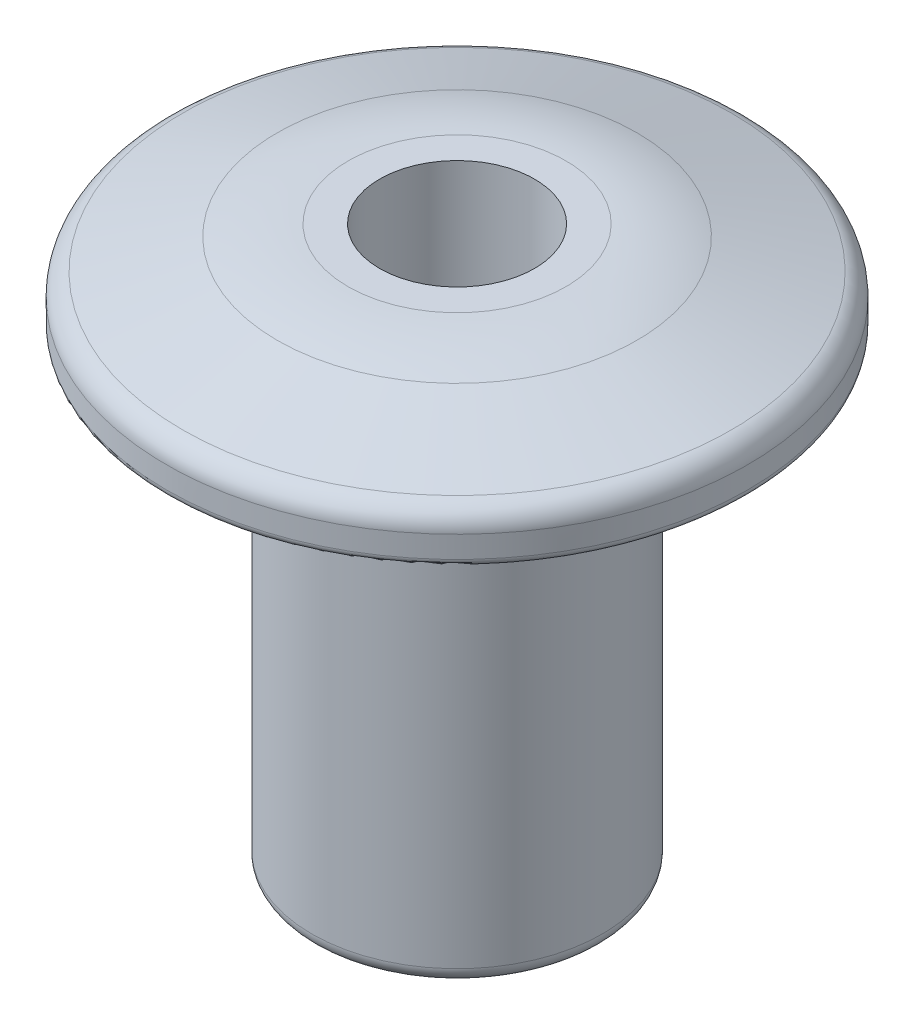
ISO-10303-21;
HEADER;
FILE_DESCRIPTION(('STEP AP214'),'2;1');
FILE_NAME('part.step','',(''),(''),'','','');
FILE_SCHEMA(('AUTOMOTIVE_DESIGN { 1 0 10303 214 1 1 1 1 }'));
ENDSEC;
DATA;
#1=APPLICATION_CONTEXT('core data for automotive mechanical design processes');
#2=APPLICATION_PROTOCOL_DEFINITION('international standard','automotive_design',2000,#1);
#3=PRODUCT_CONTEXT('',#1,'mechanical');
#4=PRODUCT('Part','Part','',(#3));
#5=PRODUCT_RELATED_PRODUCT_CATEGORY('part','',(#4));
#6=PRODUCT_DEFINITION_FORMATION('','',#4);
#7=PRODUCT_DEFINITION_CONTEXT('part definition',#1,'design');
#8=PRODUCT_DEFINITION('design','',#6,#7);
#9=PRODUCT_DEFINITION_SHAPE('','',#8);
#10=(LENGTH_UNIT() NAMED_UNIT(*) SI_UNIT(.MILLI.,.METRE.));
#11=(NAMED_UNIT(*) PLANE_ANGLE_UNIT() SI_UNIT($,.RADIAN.));
#12=(NAMED_UNIT(*) SI_UNIT($,.STERADIAN.) SOLID_ANGLE_UNIT());
#13=UNCERTAINTY_MEASURE_WITH_UNIT(LENGTH_MEASURE(1.E-05),#10,'distance_accuracy_value','');
#14=(GEOMETRIC_REPRESENTATION_CONTEXT(3) GLOBAL_UNCERTAINTY_ASSIGNED_CONTEXT((#13)) GLOBAL_UNIT_ASSIGNED_CONTEXT((#10,
#11,#12)) REPRESENTATION_CONTEXT('',''));
#15=CARTESIAN_POINT('',(0.,0.,0.));
#16=DIRECTION('',(0.,0.,1.));
#17=DIRECTION('',(1.,0.,0.));
#18=AXIS2_PLACEMENT_3D('',#15,#16,#17);
#19=CARTESIAN_POINT('',(0.,7.62,0.));
#20=DIRECTION('',(0.,-1.,0.));
#21=DIRECTION('',(0.,0.,-1.));
#22=AXIS2_PLACEMENT_3D('',#19,#20,#21);
#23=CYLINDRICAL_SURFACE('',#22,2.38125);
#24=CARTESIAN_POINT('',(0.,0.254,0.));
#25=DIRECTION('',(0.,1.,0.));
#26=DIRECTION('',(0.,0.,1.));
#27=AXIS2_PLACEMENT_3D('',#24,#25,#26);
#28=CIRCLE('',#27,2.38125);
#29=CARTESIAN_POINT('',(0.,0.254,2.38125));
#30=VERTEX_POINT('',#29);
#31=EDGE_CURVE('E65',#30,#30,#28,.T.);
#32=ORIENTED_EDGE('',*,*,#31,.T.);
#33=EDGE_LOOP('',(#32));
#34=FACE_BOUND('',#33,.T.);
#35=CARTESIAN_POINT('',(0.,7.62,0.));
#36=DIRECTION('',(0.,1.,0.));
#37=DIRECTION('',(0.,0.,1.));
#38=AXIS2_PLACEMENT_3D('',#35,#36,#37);
#39=CIRCLE('',#38,2.38125);
#40=CARTESIAN_POINT('',(0.,7.62,2.38125));
#41=VERTEX_POINT('',#40);
#42=EDGE_CURVE('E68',#41,#41,#39,.T.);
#43=ORIENTED_EDGE('',*,*,#42,.F.);
#44=EDGE_LOOP('',(#43));
#45=FACE_BOUND('',#44,.T.);
#46=ADVANCED_FACE('F30',(#34,#45),#23,.T.);
#47=CARTESIAN_POINT('',(0.,0.,0.));
#48=DIRECTION('',(0.,1.,0.));
#49=DIRECTION('',(0.,0.,1.));
#50=AXIS2_PLACEMENT_3D('',#47,#48,#49);
#51=PLANE('',#50);
#52=CARTESIAN_POINT('',(0.,0.,0.));
#53=DIRECTION('',(0.,1.,0.));
#54=DIRECTION('',(0.,0.,1.));
#55=AXIS2_PLACEMENT_3D('',#52,#53,#54);
#56=CIRCLE('',#55,2.12725);
#57=CARTESIAN_POINT('',(0.,0.,2.12725));
#58=VERTEX_POINT('',#57);
#59=EDGE_CURVE('E62',#58,#58,#56,.F.);
#60=ORIENTED_EDGE('',*,*,#59,.T.);
#61=EDGE_LOOP('',(#60));
#62=FACE_BOUND('',#61,.T.);
#63=ADVANCED_FACE('F99',(#62),#51,.F.);
#64=CARTESIAN_POINT('',(0.,9.144,0.));
#65=DIRECTION('',(0.,-1.,0.));
#66=DIRECTION('',(0.,0.,-1.));
#67=AXIS2_PLACEMENT_3D('',#64,#65,#66);
#68=CYLINDRICAL_SURFACE('',#67,4.7625);
#69=CARTESIAN_POINT('',(0.,7.747,0.));
#70=DIRECTION('',(0.,1.,0.));
#71=DIRECTION('',(0.,0.,1.));
#72=AXIS2_PLACEMENT_3D('',#69,#70,#71);
#73=CIRCLE('',#72,4.7625);
#74=CARTESIAN_POINT('',(0.,7.747,4.7625));
#75=VERTEX_POINT('',#74);
#76=EDGE_CURVE('E53',#75,#75,#73,.T.);
#77=ORIENTED_EDGE('',*,*,#76,.T.);
#78=EDGE_LOOP('',(#77));
#79=FACE_BOUND('',#78,.T.);
#80=CARTESIAN_POINT('',(0.,8.10388814326856,0.));
#81=DIRECTION('',(0.,-1.,0.));
#82=DIRECTION('',(0.,0.,-1.));
#83=AXIS2_PLACEMENT_3D('',#80,#81,#82);
#84=CIRCLE('',#83,4.7625);
#85=CARTESIAN_POINT('',(0.,8.10388814326856,-4.7625));
#86=VERTEX_POINT('',#85);
#87=EDGE_CURVE('E56',#86,#86,#84,.T.);
#88=ORIENTED_EDGE('',*,*,#87,.T.);
#89=EDGE_LOOP('',(#88));
#90=FACE_BOUND('',#89,.T.);
#91=ADVANCED_FACE('F105',(#79,#90),#68,.T.);
#92=CARTESIAN_POINT('',(0.,7.62,0.));
#93=DIRECTION('',(0.,1.,0.));
#94=DIRECTION('',(0.,0.,1.));
#95=AXIS2_PLACEMENT_3D('',#92,#93,#94);
#96=PLANE('',#95);
#97=CARTESIAN_POINT('',(0.,7.62,0.));
#98=DIRECTION('',(0.,1.,0.));
#99=DIRECTION('',(0.,0.,1.));
#100=AXIS2_PLACEMENT_3D('',#97,#98,#99);
#101=CIRCLE('',#100,4.6355);
#102=CARTESIAN_POINT('',(0.,7.62,4.6355));
#103=VERTEX_POINT('',#102);
#104=EDGE_CURVE('E50',#103,#103,#101,.F.);
#105=ORIENTED_EDGE('',*,*,#104,.T.);
#106=EDGE_LOOP('',(#105));
#107=FACE_BOUND('',#106,.T.);
#108=ORIENTED_EDGE('',*,*,#42,.T.);
#109=EDGE_LOOP('',(#108));
#110=FACE_BOUND('',#109,.T.);
#111=ADVANCED_FACE('F114',(#107,#110),#96,.F.);
#112=CARTESIAN_POINT('',(0.,0.254,0.));
#113=DIRECTION('',(0.,1.,0.));
#114=DIRECTION('',(0.,0.,1.));
#115=AXIS2_PLACEMENT_3D('',#112,#113,#114);
#116=TOROIDAL_SURFACE('',#115,2.12725,0.254);
#117=ORIENTED_EDGE('',*,*,#59,.F.);
#118=EDGE_LOOP('',(#117));
#119=FACE_BOUND('',#118,.T.);
#120=ORIENTED_EDGE('',*,*,#31,.F.);
#121=EDGE_LOOP('',(#120));
#122=FACE_BOUND('',#121,.T.);
#123=ADVANCED_FACE('F111',(#119,#122),#116,.T.);
#124=CARTESIAN_POINT('',(0.,8.382,0.));
#125=DIRECTION('',(0.,-1.,0.));
#126=DIRECTION('',(0.,0.,-1.));
#127=AXIS2_PLACEMENT_3D('',#124,#125,#126);
#128=CONICAL_SURFACE('',#127,4.7625,1.26109338225244);
#129=CARTESIAN_POINT('',(0.,8.96273600082943,0.));
#130=DIRECTION('',(0.,-1.,0.));
#131=DIRECTION('',(0.,0.,-1.));
#132=AXIS2_PLACEMENT_3D('',#129,#130,#131);
#133=CIRCLE('',#132,2.94769999740805);
#134=CARTESIAN_POINT('',(0.,8.96273600082943,-2.94769999740805));
#135=VERTEX_POINT('',#134);
#136=EDGE_CURVE('E41',#135,#135,#133,.T.);
#137=ORIENTED_EDGE('',*,*,#136,.T.);
#138=EDGE_LOOP('',(#137));
#139=FACE_BOUND('',#138,.T.);
#140=CARTESIAN_POINT('',(0.,8.4667617433515,0.));
#141=DIRECTION('',(0.,1.,0.));
#142=DIRECTION('',(0.,0.,1.));
#143=AXIS2_PLACEMENT_3D('',#140,#141,#142);
#144=CIRCLE('',#143,4.49761955202654);
#145=CARTESIAN_POINT('',(0.,8.4667617433515,4.49761955202654));
#146=VERTEX_POINT('',#145);
#147=EDGE_CURVE('E59',#146,#146,#144,.T.);
#148=ORIENTED_EDGE('',*,*,#147,.T.);
#149=EDGE_LOOP('',(#148));
#150=FACE_BOUND('',#149,.T.);
#151=ADVANCED_FACE('F81',(#139,#150),#128,.T.);
#152=CARTESIAN_POINT('',(0.,9.144,0.));
#153=DIRECTION('',(0.,1.,0.));
#154=DIRECTION('',(0.,0.,1.));
#155=AXIS2_PLACEMENT_3D('',#152,#153,#154);
#156=PLANE('',#155);
#157=CARTESIAN_POINT('',(0.,9.144,0.));
#158=DIRECTION('',(0.,1.,0.));
#159=DIRECTION('',(0.,0.,1.));
#160=AXIS2_PLACEMENT_3D('',#157,#158,#159);
#161=CIRCLE('',#160,1.27);
#162=CARTESIAN_POINT('',(0.,9.144,1.27));
#163=VERTEX_POINT('',#162);
#164=EDGE_CURVE('E71',#163,#163,#161,.T.);
#165=ORIENTED_EDGE('',*,*,#164,.F.);
#166=EDGE_LOOP('',(#165));
#167=FACE_BOUND('',#166,.T.);
#168=CARTESIAN_POINT('',(0.,9.144,0.));
#169=DIRECTION('',(0.,1.,0.));
#170=DIRECTION('',(0.,0.,1.));
#171=AXIS2_PLACEMENT_3D('',#168,#169,#170);
#172=CIRCLE('',#171,1.78650447714263);
#173=CARTESIAN_POINT('',(0.,9.144,1.78650447714263));
#174=VERTEX_POINT('',#173);
#175=EDGE_CURVE('E45',#174,#174,#172,.T.);
#176=ORIENTED_EDGE('',*,*,#175,.T.);
#177=EDGE_LOOP('',(#176));
#178=FACE_BOUND('',#177,.T.);
#179=ADVANCED_FACE('F77',(#167,#178),#156,.T.);
#180=CARTESIAN_POINT('',(0.,8.10388814326856,0.));
#181=DIRECTION('',(0.,-1.,0.));
#182=DIRECTION('',(0.,0.,-1.));
#183=AXIS2_PLACEMENT_3D('',#180,#181,#182);
#184=TOROIDAL_SURFACE('',#183,4.3815,0.381);
#185=ORIENTED_EDGE('',*,*,#87,.F.);
#186=EDGE_LOOP('',(#185));
#187=FACE_BOUND('',#186,.T.);
#188=ORIENTED_EDGE('',*,*,#147,.F.);
#189=EDGE_LOOP('',(#188));
#190=FACE_BOUND('',#189,.T.);
#191=ADVANCED_FACE('F80',(#187,#190),#184,.T.);
#192=CARTESIAN_POINT('',(0.,7.747,0.));
#193=DIRECTION('',(0.,1.,0.));
#194=DIRECTION('',(0.,0.,1.));
#195=AXIS2_PLACEMENT_3D('',#192,#193,#194);
#196=TOROIDAL_SURFACE('',#195,4.6355,0.127);
#197=ORIENTED_EDGE('',*,*,#104,.F.);
#198=EDGE_LOOP('',(#197));
#199=FACE_BOUND('',#198,.T.);
#200=ORIENTED_EDGE('',*,*,#76,.F.);
#201=EDGE_LOOP('',(#200));
#202=FACE_BOUND('',#201,.T.);
#203=ADVANCED_FACE('F87',(#199,#202),#196,.T.);
#204=CARTESIAN_POINT('',(0.,5.334,0.));
#205=DIRECTION('',(0.,1.,0.));
#206=DIRECTION('',(0.,0.,1.));
#207=AXIS2_PLACEMENT_3D('',#204,#205,#206);
#208=DEGENERATE_TOROIDAL_SURFACE('',#207,1.78650447714263,3.81,.T.);
#209=ORIENTED_EDGE('',*,*,#136,.F.);
#210=EDGE_LOOP('',(#209));
#211=FACE_BOUND('',#210,.T.);
#212=ORIENTED_EDGE('',*,*,#175,.F.);
#213=EDGE_LOOP('',(#212));
#214=FACE_BOUND('',#213,.T.);
#215=ADVANCED_FACE('F85',(#211,#214),#208,.T.);
#216=CARTESIAN_POINT('',(0.,6.604,0.));
#217=DIRECTION('',(0.,1.,0.));
#218=DIRECTION('',(0.,0.,1.));
#219=AXIS2_PLACEMENT_3D('',#216,#217,#218);
#220=CYLINDRICAL_SURFACE('',#219,1.27);
#221=CARTESIAN_POINT('',(0.,7.239,0.));
#222=DIRECTION('',(0.,1.,0.));
#223=DIRECTION('',(0.,0.,1.));
#224=AXIS2_PLACEMENT_3D('',#221,#222,#223);
#225=CIRCLE('',#224,1.27);
#226=CARTESIAN_POINT('',(0.,7.239,1.27));
#227=VERTEX_POINT('',#226);
#228=EDGE_CURVE('E10',#227,#227,#225,.F.);
#229=ORIENTED_EDGE('',*,*,#228,.T.);
#230=EDGE_LOOP('',(#229));
#231=FACE_BOUND('',#230,.T.);
#232=ORIENTED_EDGE('',*,*,#164,.T.);
#233=EDGE_LOOP('',(#232));
#234=FACE_BOUND('',#233,.T.);
#235=ADVANCED_FACE('F75',(#231,#234),#220,.F.);
#236=CARTESIAN_POINT('',(0.,6.604,0.));
#237=DIRECTION('',(0.,1.,0.));
#238=DIRECTION('',(0.,0.,1.));
#239=AXIS2_PLACEMENT_3D('',#236,#237,#238);
#240=PLANE('',#239);
#241=CARTESIAN_POINT('',(0.,6.604,0.));
#242=DIRECTION('',(0.,1.,0.));
#243=DIRECTION('',(0.,0.,1.));
#244=AXIS2_PLACEMENT_3D('',#241,#242,#243);
#245=CIRCLE('',#244,0.635);
#246=CARTESIAN_POINT('',(0.,6.604,0.635));
#247=VERTEX_POINT('',#246);
#248=EDGE_CURVE('E37',#247,#247,#245,.T.);
#249=ORIENTED_EDGE('',*,*,#248,.T.);
#250=EDGE_LOOP('',(#249));
#251=FACE_BOUND('',#250,.T.);
#252=ADVANCED_FACE('F93',(#251),#240,.T.);
#253=CARTESIAN_POINT('',(0.,7.239,0.));
#254=DIRECTION('',(0.,1.,0.));
#255=DIRECTION('',(0.,0.,1.));
#256=AXIS2_PLACEMENT_3D('',#253,#254,#255);
#257=DEGENERATE_TOROIDAL_SURFACE('',#256,0.635,0.635,.T.);
#258=ORIENTED_EDGE('',*,*,#228,.F.);
#259=EDGE_LOOP('',(#258));
#260=FACE_BOUND('',#259,.T.);
#261=ORIENTED_EDGE('',*,*,#248,.F.);
#262=EDGE_LOOP('',(#261));
#263=FACE_BOUND('',#262,.T.);
#264=ADVANCED_FACE('F32',(#260,#263),#257,.F.);
#265=CLOSED_SHELL('',(#46,#63,#91,#111,#123,#151,#179,#191,#203,#215,#235,#252,#264));
#266=MANIFOLD_SOLID_BREP('B2',#265);
#267=ADVANCED_BREP_SHAPE_REPRESENTATION('',(#18,#266),#14);
#268=SHAPE_DEFINITION_REPRESENTATION(#9,#267);
ENDSEC;
END-ISO-10303-21;
